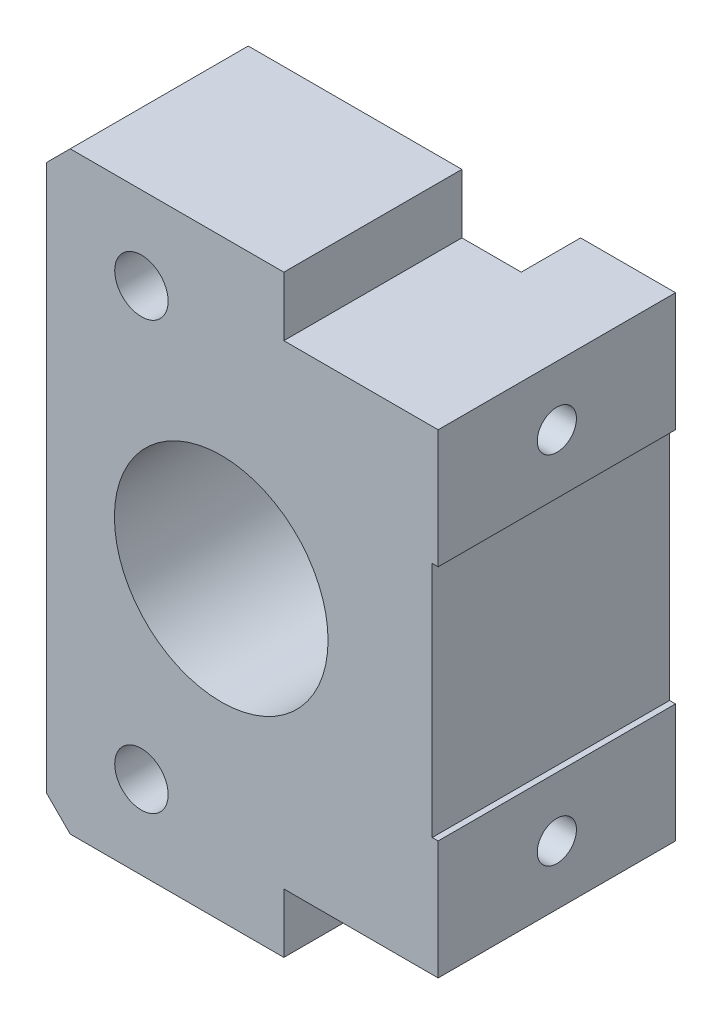
ISO-10303-21;
HEADER;
FILE_DESCRIPTION(('STEP AP214'),'2;1');
FILE_NAME('part.step','',(''),(''),'','','');
FILE_SCHEMA(('AUTOMOTIVE_DESIGN { 1 0 10303 214 1 1 1 1 }'));
ENDSEC;
DATA;
#1=APPLICATION_CONTEXT('core data for automotive mechanical design processes');
#2=APPLICATION_PROTOCOL_DEFINITION('international standard','automotive_design',2000,#1);
#3=PRODUCT_CONTEXT('',#1,'mechanical');
#4=PRODUCT('Part','Part','',(#3));
#5=PRODUCT_RELATED_PRODUCT_CATEGORY('part','',(#4));
#6=PRODUCT_DEFINITION_FORMATION('','',#4);
#7=PRODUCT_DEFINITION_CONTEXT('part definition',#1,'design');
#8=PRODUCT_DEFINITION('design','',#6,#7);
#9=PRODUCT_DEFINITION_SHAPE('','',#8);
#10=(LENGTH_UNIT() NAMED_UNIT(*) SI_UNIT(.MILLI.,.METRE.));
#11=(NAMED_UNIT(*) PLANE_ANGLE_UNIT() SI_UNIT($,.RADIAN.));
#12=(NAMED_UNIT(*) SI_UNIT($,.STERADIAN.) SOLID_ANGLE_UNIT());
#13=UNCERTAINTY_MEASURE_WITH_UNIT(LENGTH_MEASURE(1.E-05),#10,'distance_accuracy_value','');
#14=(GEOMETRIC_REPRESENTATION_CONTEXT(3) GLOBAL_UNCERTAINTY_ASSIGNED_CONTEXT((#13)) GLOBAL_UNIT_ASSIGNED_CONTEXT((#10,
#11,#12)) REPRESENTATION_CONTEXT('',''));
#15=CARTESIAN_POINT('',(0.,0.,0.));
#16=DIRECTION('',(0.,0.,1.));
#17=DIRECTION('',(1.,0.,0.));
#18=AXIS2_PLACEMENT_3D('',#15,#16,#17);
#19=CARTESIAN_POINT('',(0.,0.,15.));
#20=DIRECTION('',(0.,0.,-1.));
#21=DIRECTION('',(-1.,0.,0.));
#22=AXIS2_PLACEMENT_3D('',#19,#20,#21);
#23=PLANE('',#22);
#24=CARTESIAN_POINT('',(-30.3333333333333,-18.2777777777778,15.));
#25=DIRECTION('',(0.,0.,-1.));
#26=DIRECTION('',(-1.,0.,0.));
#27=AXIS2_PLACEMENT_3D('',#24,#25,#26);
#28=CIRCLE('',#27,2.25);
#29=CARTESIAN_POINT('',(-32.5833333333333,-18.2777777777778,15.));
#30=VERTEX_POINT('',#29);
#31=EDGE_CURVE('E209',#30,#30,#28,.T.);
#32=ORIENTED_EDGE('',*,*,#31,.T.);
#33=EDGE_LOOP('',(#32));
#34=FACE_BOUND('',#33,.T.);
#35=CARTESIAN_POINT('',(-30.3333333333333,17.7222222222222,15.));
#36=DIRECTION('',(0.,0.,-1.));
#37=DIRECTION('',(-1.,0.,0.));
#38=AXIS2_PLACEMENT_3D('',#35,#36,#37);
#39=CIRCLE('',#38,2.25);
#40=CARTESIAN_POINT('',(-32.5833333333333,17.7222222222222,15.));
#41=VERTEX_POINT('',#40);
#42=EDGE_CURVE('E215',#41,#41,#39,.T.);
#43=ORIENTED_EDGE('',*,*,#42,.T.);
#44=EDGE_LOOP('',(#43));
#45=FACE_BOUND('',#44,.T.);
#46=DIRECTION('',(-1.,0.,0.));
#47=VECTOR('',#46,1.);
#48=CARTESIAN_POINT('',(-38.3333333333333,24.7222222222222,15.));
#49=LINE('',#48,#47);
#50=CARTESIAN_POINT('',(-18.3333333333333,24.7222222222222,15.));
#51=VERTEX_POINT('',#50);
#52=CARTESIAN_POINT('',(-36.3333333333333,24.7222222222222,15.));
#53=VERTEX_POINT('',#52);
#54=EDGE_CURVE('E260',#51,#53,#49,.T.);
#55=ORIENTED_EDGE('',*,*,#54,.T.);
#56=DIRECTION('',(0.707106781186549,0.707106781186546,0.));
#57=VECTOR('',#56,1.);
#58=CARTESIAN_POINT('',(-38.3333333333333,22.7222222222222,15.));
#59=LINE('',#58,#57);
#60=CARTESIAN_POINT('',(-38.3333333333333,22.7222222222222,15.));
#61=VERTEX_POINT('',#60);
#62=EDGE_CURVE('E43',#53,#61,#59,.F.);
#63=ORIENTED_EDGE('',*,*,#62,.T.);
#64=DIRECTION('',(0.,-1.,0.));
#65=VECTOR('',#64,1.);
#66=CARTESIAN_POINT('',(-38.3333333333333,-25.2777777777778,15.));
#67=LINE('',#66,#65);
#68=CARTESIAN_POINT('',(-38.3333333333333,-23.2777777777778,15.));
#69=VERTEX_POINT('',#68);
#70=EDGE_CURVE('E262',#61,#69,#67,.T.);
#71=ORIENTED_EDGE('',*,*,#70,.T.);
#72=DIRECTION('',(-0.707106781186546,0.707106781186549,0.));
#73=VECTOR('',#72,1.);
#74=CARTESIAN_POINT('',(-36.3333333333333,-25.2777777777778,15.));
#75=LINE('',#74,#73);
#76=CARTESIAN_POINT('',(-36.3333333333333,-25.2777777777778,15.));
#77=VERTEX_POINT('',#76);
#78=EDGE_CURVE('E50',#69,#77,#75,.F.);
#79=ORIENTED_EDGE('',*,*,#78,.T.);
#80=DIRECTION('',(1.,0.,0.));
#81=VECTOR('',#80,1.);
#82=CARTESIAN_POINT('',(-18.3333333333333,-25.2777777777778,15.));
#83=LINE('',#82,#81);
#84=CARTESIAN_POINT('',(-18.3333333333333,-25.2777777777778,15.));
#85=VERTEX_POINT('',#84);
#86=EDGE_CURVE('E239',#77,#85,#83,.T.);
#87=ORIENTED_EDGE('',*,*,#86,.T.);
#88=DIRECTION('',(0.,1.,0.));
#89=VECTOR('',#88,1.);
#90=CARTESIAN_POINT('',(-18.3333333333333,-20.2777777777778,15.));
#91=LINE('',#90,#89);
#92=CARTESIAN_POINT('',(-18.3333333333333,-20.2777777777778,15.));
#93=VERTEX_POINT('',#92);
#94=EDGE_CURVE('E241',#85,#93,#91,.T.);
#95=ORIENTED_EDGE('',*,*,#94,.T.);
#96=DIRECTION('',(1.,0.,0.));
#97=VECTOR('',#96,1.);
#98=CARTESIAN_POINT('',(-5.33333333333332,-20.2777777777778,15.));
#99=LINE('',#98,#97);
#100=CARTESIAN_POINT('',(-5.33333333333332,-20.2777777777778,15.));
#101=VERTEX_POINT('',#100);
#102=EDGE_CURVE('E244',#93,#101,#99,.T.);
#103=ORIENTED_EDGE('',*,*,#102,.T.);
#104=DIRECTION('',(0.,1.,0.));
#105=VECTOR('',#104,1.);
#106=CARTESIAN_POINT('',(-5.33333333333333,-10.2777777777778,15.));
#107=LINE('',#106,#105);
#108=CARTESIAN_POINT('',(-5.33333333333333,-10.2777777777778,15.));
#109=VERTEX_POINT('',#108);
#110=EDGE_CURVE('E246',#101,#109,#107,.T.);
#111=ORIENTED_EDGE('',*,*,#110,.T.);
#112=DIRECTION('',(-1.,0.,0.));
#113=VECTOR('',#112,1.);
#114=CARTESIAN_POINT('',(-5.83333333333334,-10.2777777777778,15.));
#115=LINE('',#114,#113);
#116=CARTESIAN_POINT('',(-5.83333333333334,-10.2777777777778,15.));
#117=VERTEX_POINT('',#116);
#118=EDGE_CURVE('E248',#109,#117,#115,.T.);
#119=ORIENTED_EDGE('',*,*,#118,.T.);
#120=DIRECTION('',(0.,1.,0.));
#121=VECTOR('',#120,1.);
#122=CARTESIAN_POINT('',(-5.83333333333335,9.72222222222221,15.));
#123=LINE('',#122,#121);
#124=CARTESIAN_POINT('',(-5.83333333333335,9.72222222222221,15.));
#125=VERTEX_POINT('',#124);
#126=EDGE_CURVE('E250',#117,#125,#123,.T.);
#127=ORIENTED_EDGE('',*,*,#126,.T.);
#128=DIRECTION('',(1.,0.,0.));
#129=VECTOR('',#128,1.);
#130=CARTESIAN_POINT('',(-5.33333333333335,9.72222222222221,15.));
#131=LINE('',#130,#129);
#132=CARTESIAN_POINT('',(-5.33333333333335,9.72222222222221,15.));
#133=VERTEX_POINT('',#132);
#134=EDGE_CURVE('E252',#125,#133,#131,.T.);
#135=ORIENTED_EDGE('',*,*,#134,.T.);
#136=DIRECTION('',(0.,1.,0.));
#137=VECTOR('',#136,1.);
#138=CARTESIAN_POINT('',(-5.33333333333335,19.7222222222222,15.));
#139=LINE('',#138,#137);
#140=CARTESIAN_POINT('',(-5.33333333333335,19.7222222222222,15.));
#141=VERTEX_POINT('',#140);
#142=EDGE_CURVE('E254',#133,#141,#139,.T.);
#143=ORIENTED_EDGE('',*,*,#142,.T.);
#144=DIRECTION('',(-1.,0.,0.));
#145=VECTOR('',#144,1.);
#146=CARTESIAN_POINT('',(-18.3333333333333,19.7222222222222,15.));
#147=LINE('',#146,#145);
#148=CARTESIAN_POINT('',(-18.3333333333333,19.7222222222222,15.));
#149=VERTEX_POINT('',#148);
#150=EDGE_CURVE('E256',#141,#149,#147,.T.);
#151=ORIENTED_EDGE('',*,*,#150,.T.);
#152=DIRECTION('',(0.,1.,0.));
#153=VECTOR('',#152,1.);
#154=CARTESIAN_POINT('',(-18.3333333333333,24.7222222222222,15.));
#155=LINE('',#154,#153);
#156=EDGE_CURVE('E258',#149,#51,#155,.T.);
#157=ORIENTED_EDGE('',*,*,#156,.T.);
#158=EDGE_LOOP('',(#55,#63,#71,#79,#87,#95,#103,#111,#119,#127,#135,#143,#151,#157));
#159=FACE_BOUND('',#158,.T.);
#160=CARTESIAN_POINT('',(-23.6085196490635,-0.277777777777787,15.));
#161=DIRECTION('',(0.,0.,1.));
#162=DIRECTION('',(1.,0.,0.));
#163=AXIS2_PLACEMENT_3D('',#160,#161,#162);
#164=CIRCLE('',#163,9.);
#165=CARTESIAN_POINT('',(-14.6085196490635,-0.277777777777787,15.));
#166=VERTEX_POINT('',#165);
#167=EDGE_CURVE('E233',#166,#166,#164,.T.);
#168=ORIENTED_EDGE('',*,*,#167,.F.);
#169=EDGE_LOOP('',(#168));
#170=FACE_BOUND('',#169,.T.);
#171=ADVANCED_FACE('F35',(#34,#45,#159,#170),#23,.F.);
#172=CARTESIAN_POINT('',(0.,0.,0.));
#173=DIRECTION('',(0.,0.,-1.));
#174=DIRECTION('',(-1.,0.,0.));
#175=AXIS2_PLACEMENT_3D('',#172,#173,#174);
#176=PLANE('',#175);
#177=DIRECTION('',(0.,-1.,0.));
#178=VECTOR('',#177,1.);
#179=CARTESIAN_POINT('',(-38.3333333333333,-25.2777777777778,0.));
#180=LINE('',#179,#178);
#181=CARTESIAN_POINT('',(-38.3333333333333,22.7222222222222,0.));
#182=VERTEX_POINT('',#181);
#183=CARTESIAN_POINT('',(-38.3333333333333,-23.2777777777778,0.));
#184=VERTEX_POINT('',#183);
#185=EDGE_CURVE('E242',#182,#184,#180,.T.);
#186=ORIENTED_EDGE('',*,*,#185,.F.);
#187=DIRECTION('',(-0.707106781186549,-0.707106781186546,0.));
#188=VECTOR('',#187,1.);
#189=CARTESIAN_POINT('',(-30.5277777777777,30.5277777777778,0.));
#190=LINE('',#189,#188);
#191=CARTESIAN_POINT('',(-36.3333333333333,24.7222222222222,0.));
#192=VERTEX_POINT('',#191);
#193=EDGE_CURVE('E309',#182,#192,#190,.F.);
#194=ORIENTED_EDGE('',*,*,#193,.T.);
#195=DIRECTION('',(-1.,0.,0.));
#196=VECTOR('',#195,1.);
#197=CARTESIAN_POINT('',(-38.3333333333333,24.7222222222222,0.));
#198=LINE('',#197,#196);
#199=CARTESIAN_POINT('',(-18.3333333333333,24.7222222222222,0.));
#200=VERTEX_POINT('',#199);
#201=EDGE_CURVE('E275',#200,#192,#198,.T.);
#202=ORIENTED_EDGE('',*,*,#201,.F.);
#203=DIRECTION('',(0.,1.,0.));
#204=VECTOR('',#203,1.);
#205=CARTESIAN_POINT('',(-18.3333333333333,24.7222222222222,0.));
#206=LINE('',#205,#204);
#207=CARTESIAN_POINT('',(-18.3333333333333,19.7222222222222,0.));
#208=VERTEX_POINT('',#207);
#209=EDGE_CURVE('E273',#208,#200,#206,.T.);
#210=ORIENTED_EDGE('',*,*,#209,.F.);
#211=DIRECTION('',(-1.,0.,0.));
#212=VECTOR('',#211,1.);
#213=CARTESIAN_POINT('',(-18.3333333333333,19.7222222222222,0.));
#214=LINE('',#213,#212);
#215=CARTESIAN_POINT('',(-13.3333333333333,19.7222222222222,0.));
#216=VERTEX_POINT('',#215);
#217=EDGE_CURVE('E271',#216,#208,#214,.T.);
#218=ORIENTED_EDGE('',*,*,#217,.F.);
#219=DIRECTION('',(0.,1.,0.));
#220=VECTOR('',#219,1.);
#221=CARTESIAN_POINT('',(-13.3333333333333,19.7222222222222,0.));
#222=LINE('',#221,#220);
#223=CARTESIAN_POINT('',(-13.3333333333333,-20.2777777777778,0.));
#224=VERTEX_POINT('',#223);
#225=EDGE_CURVE('E176',#224,#216,#222,.T.);
#226=ORIENTED_EDGE('',*,*,#225,.F.);
#227=DIRECTION('',(1.,0.,0.));
#228=VECTOR('',#227,1.);
#229=CARTESIAN_POINT('',(-5.33333333333332,-20.2777777777778,0.));
#230=LINE('',#229,#228);
#231=CARTESIAN_POINT('',(-18.3333333333333,-20.2777777777778,0.));
#232=VERTEX_POINT('',#231);
#233=EDGE_CURVE('E268',#232,#224,#230,.T.);
#234=ORIENTED_EDGE('',*,*,#233,.F.);
#235=DIRECTION('',(0.,1.,0.));
#236=VECTOR('',#235,1.);
#237=CARTESIAN_POINT('',(-18.3333333333333,-20.2777777777778,0.));
#238=LINE('',#237,#236);
#239=CARTESIAN_POINT('',(-18.3333333333333,-25.2777777777778,0.));
#240=VERTEX_POINT('',#239);
#241=EDGE_CURVE('E266',#240,#232,#238,.T.);
#242=ORIENTED_EDGE('',*,*,#241,.F.);
#243=DIRECTION('',(1.,0.,0.));
#244=VECTOR('',#243,1.);
#245=CARTESIAN_POINT('',(-18.3333333333333,-25.2777777777778,0.));
#246=LINE('',#245,#244);
#247=CARTESIAN_POINT('',(-36.3333333333333,-25.2777777777778,0.));
#248=VERTEX_POINT('',#247);
#249=EDGE_CURVE('E236',#248,#240,#246,.T.);
#250=ORIENTED_EDGE('',*,*,#249,.F.);
#251=DIRECTION('',(0.707106781186546,-0.707106781186549,0.));
#252=VECTOR('',#251,1.);
#253=CARTESIAN_POINT('',(-30.8055555555556,-30.8055555555555,0.));
#254=LINE('',#253,#252);
#255=EDGE_CURVE('E307',#248,#184,#254,.F.);
#256=ORIENTED_EDGE('',*,*,#255,.T.);
#257=EDGE_LOOP('',(#186,#194,#202,#210,#218,#226,#234,#242,#250,#256));
#258=FACE_BOUND('',#257,.T.);
#259=CARTESIAN_POINT('',(-30.3333333333333,-18.2777777777778,0.));
#260=DIRECTION('',(0.,0.,-1.));
#261=DIRECTION('',(-1.,0.,0.));
#262=AXIS2_PLACEMENT_3D('',#259,#260,#261);
#263=CIRCLE('',#262,4.00000000000001);
#264=CARTESIAN_POINT('',(-34.3333333333333,-18.2777777777778,0.));
#265=VERTEX_POINT('',#264);
#266=EDGE_CURVE('E218',#265,#265,#263,.T.);
#267=ORIENTED_EDGE('',*,*,#266,.F.);
#268=EDGE_LOOP('',(#267));
#269=FACE_BOUND('',#268,.T.);
#270=CARTESIAN_POINT('',(-30.3333333333333,17.7222222222222,0.));
#271=DIRECTION('',(0.,0.,-1.));
#272=DIRECTION('',(-1.,0.,0.));
#273=AXIS2_PLACEMENT_3D('',#270,#271,#272);
#274=CIRCLE('',#273,4.00000000000001);
#275=CARTESIAN_POINT('',(-34.3333333333333,17.7222222222222,0.));
#276=VERTEX_POINT('',#275);
#277=EDGE_CURVE('E224',#276,#276,#274,.T.);
#278=ORIENTED_EDGE('',*,*,#277,.F.);
#279=EDGE_LOOP('',(#278));
#280=FACE_BOUND('',#279,.T.);
#281=CARTESIAN_POINT('',(-23.6085196490635,-0.277777777777787,0.));
#282=DIRECTION('',(0.,0.,1.));
#283=DIRECTION('',(1.,0.,0.));
#284=AXIS2_PLACEMENT_3D('',#281,#282,#283);
#285=CIRCLE('',#284,9.);
#286=CARTESIAN_POINT('',(-14.6085196490635,-0.277777777777787,0.));
#287=VERTEX_POINT('',#286);
#288=EDGE_CURVE('E230',#287,#287,#285,.T.);
#289=ORIENTED_EDGE('',*,*,#288,.T.);
#290=EDGE_LOOP('',(#289));
#291=FACE_BOUND('',#290,.T.);
#292=ADVANCED_FACE('F324',(#258,#269,#280,#291),#176,.T.);
#293=CARTESIAN_POINT('',(-18.3333333333333,-25.2777777777778,15.));
#294=DIRECTION('',(0.,1.,0.));
#295=DIRECTION('',(-1.,0.,0.));
#296=AXIS2_PLACEMENT_3D('',#293,#294,#295);
#297=PLANE('',#296);
#298=ORIENTED_EDGE('',*,*,#86,.F.);
#299=DIRECTION('',(0.,0.,-1.));
#300=VECTOR('',#299,1.);
#301=CARTESIAN_POINT('',(-36.3333333333333,-25.2777777777778,15.));
#302=LINE('',#301,#300);
#303=EDGE_CURVE('E11',#77,#248,#302,.T.);
#304=ORIENTED_EDGE('',*,*,#303,.T.);
#305=ORIENTED_EDGE('',*,*,#249,.T.);
#306=DIRECTION('',(0.,0.,-1.));
#307=VECTOR('',#306,1.);
#308=CARTESIAN_POINT('',(-18.3333333333333,-25.2777777777778,15.));
#309=LINE('',#308,#307);
#310=EDGE_CURVE('E299',#85,#240,#309,.T.);
#311=ORIENTED_EDGE('',*,*,#310,.F.);
#312=EDGE_LOOP('',(#298,#304,#305,#311));
#313=FACE_BOUND('',#312,.T.);
#314=ADVANCED_FACE('F354',(#313),#297,.F.);
#315=CARTESIAN_POINT('',(-18.3333333333333,-20.2777777777778,15.));
#316=DIRECTION('',(-1.,0.,0.));
#317=DIRECTION('',(0.,0.,1.));
#318=AXIS2_PLACEMENT_3D('',#315,#316,#317);
#319=PLANE('',#318);
#320=ORIENTED_EDGE('',*,*,#241,.T.);
#321=DIRECTION('',(0.,0.,-1.));
#322=VECTOR('',#321,1.);
#323=CARTESIAN_POINT('',(-18.3333333333333,-20.2777777777778,15.));
#324=LINE('',#323,#322);
#325=EDGE_CURVE('E296',#93,#232,#324,.T.);
#326=ORIENTED_EDGE('',*,*,#325,.F.);
#327=ORIENTED_EDGE('',*,*,#94,.F.);
#328=ORIENTED_EDGE('',*,*,#310,.T.);
#329=EDGE_LOOP('',(#320,#326,#327,#328));
#330=FACE_BOUND('',#329,.T.);
#331=ADVANCED_FACE('F352',(#330),#319,.F.);
#332=CARTESIAN_POINT('',(-5.33333333333332,-20.2777777777778,15.));
#333=DIRECTION('',(0.,1.,0.));
#334=DIRECTION('',(0.,0.,1.));
#335=AXIS2_PLACEMENT_3D('',#332,#333,#334);
#336=PLANE('',#335);
#337=ORIENTED_EDGE('',*,*,#233,.T.);
#338=DIRECTION('',(0.,0.,1.));
#339=VECTOR('',#338,1.);
#340=CARTESIAN_POINT('',(-13.3333333333333,-20.2777777777778,-5.));
#341=LINE('',#340,#339);
#342=CARTESIAN_POINT('',(-13.3333333333333,-20.2777777777778,-5.));
#343=VERTEX_POINT('',#342);
#344=EDGE_CURVE('E200',#343,#224,#341,.T.);
#345=ORIENTED_EDGE('',*,*,#344,.F.);
#346=DIRECTION('',(-1.,0.,0.));
#347=VECTOR('',#346,1.);
#348=CARTESIAN_POINT('',(-13.3333333333333,-20.2777777777778,-5.));
#349=LINE('',#348,#347);
#350=CARTESIAN_POINT('',(-5.33333333333332,-20.2777777777778,-5.));
#351=VERTEX_POINT('',#350);
#352=EDGE_CURVE('E198',#351,#343,#349,.T.);
#353=ORIENTED_EDGE('',*,*,#352,.F.);
#354=DIRECTION('',(0.,0.,-1.));
#355=VECTOR('',#354,1.);
#356=CARTESIAN_POINT('',(-5.33333333333332,-20.2777777777778,15.));
#357=LINE('',#356,#355);
#358=EDGE_CURVE('E294',#101,#351,#357,.T.);
#359=ORIENTED_EDGE('',*,*,#358,.F.);
#360=ORIENTED_EDGE('',*,*,#102,.F.);
#361=ORIENTED_EDGE('',*,*,#325,.T.);
#362=EDGE_LOOP('',(#337,#345,#353,#359,#360,#361));
#363=FACE_BOUND('',#362,.T.);
#364=ADVANCED_FACE('F343',(#363),#336,.F.);
#365=CARTESIAN_POINT('',(-5.33333333333333,-10.2777777777778,15.));
#366=DIRECTION('',(-1.,0.,0.));
#367=DIRECTION('',(0.,-1.,0.));
#368=AXIS2_PLACEMENT_3D('',#365,#366,#367);
#369=PLANE('',#368);
#370=CARTESIAN_POINT('',(-5.33333333333334,-15.2777777777778,5.));
#371=DIRECTION('',(1.,0.,0.));
#372=DIRECTION('',(0.,0.,-1.));
#373=AXIS2_PLACEMENT_3D('',#370,#371,#372);
#374=CIRCLE('',#373,1.65);
#375=CARTESIAN_POINT('',(-5.33333333333334,-15.2777777777778,3.35));
#376=VERTEX_POINT('',#375);
#377=EDGE_CURVE('E165',#376,#376,#374,.T.);
#378=ORIENTED_EDGE('',*,*,#377,.F.);
#379=EDGE_LOOP('',(#378));
#380=FACE_BOUND('',#379,.T.);
#381=ORIENTED_EDGE('',*,*,#358,.T.);
#382=DIRECTION('',(0.,-1.,0.));
#383=VECTOR('',#382,1.);
#384=CARTESIAN_POINT('',(-5.33333333333332,-20.2777777777778,-5.));
#385=LINE('',#384,#383);
#386=CARTESIAN_POINT('',(-5.33333333333333,-10.2777777777778,-5.));
#387=VERTEX_POINT('',#386);
#388=EDGE_CURVE('E195',#387,#351,#385,.T.);
#389=ORIENTED_EDGE('',*,*,#388,.F.);
#390=DIRECTION('',(0.,0.,-1.));
#391=VECTOR('',#390,1.);
#392=CARTESIAN_POINT('',(-5.33333333333333,-10.2777777777778,15.));
#393=LINE('',#392,#391);
#394=EDGE_CURVE('E292',#109,#387,#393,.T.);
#395=ORIENTED_EDGE('',*,*,#394,.F.);
#396=ORIENTED_EDGE('',*,*,#110,.F.);
#397=EDGE_LOOP('',(#381,#389,#395,#396));
#398=FACE_BOUND('',#397,.T.);
#399=ADVANCED_FACE('F401',(#380,#398),#369,.F.);
#400=CARTESIAN_POINT('',(-5.83333333333334,-10.2777777777778,15.));
#401=DIRECTION('',(0.,-1.,0.));
#402=DIRECTION('',(1.,0.,0.));
#403=AXIS2_PLACEMENT_3D('',#400,#401,#402);
#404=PLANE('',#403);
#405=ORIENTED_EDGE('',*,*,#394,.T.);
#406=DIRECTION('',(1.,0.,0.));
#407=VECTOR('',#406,1.);
#408=CARTESIAN_POINT('',(-5.33333333333333,-10.2777777777778,-5.));
#409=LINE('',#408,#407);
#410=CARTESIAN_POINT('',(-5.83333333333334,-10.2777777777778,-5.));
#411=VERTEX_POINT('',#410);
#412=EDGE_CURVE('E192',#411,#387,#409,.T.);
#413=ORIENTED_EDGE('',*,*,#412,.F.);
#414=DIRECTION('',(0.,0.,-1.));
#415=VECTOR('',#414,1.);
#416=CARTESIAN_POINT('',(-5.83333333333334,-10.2777777777778,15.));
#417=LINE('',#416,#415);
#418=EDGE_CURVE('E290',#117,#411,#417,.T.);
#419=ORIENTED_EDGE('',*,*,#418,.F.);
#420=ORIENTED_EDGE('',*,*,#118,.F.);
#421=EDGE_LOOP('',(#405,#413,#419,#420));
#422=FACE_BOUND('',#421,.T.);
#423=ADVANCED_FACE('F397',(#422),#404,.F.);
#424=CARTESIAN_POINT('',(-5.83333333333335,9.72222222222221,15.));
#425=DIRECTION('',(-1.,0.,0.));
#426=DIRECTION('',(0.,-1.,0.));
#427=AXIS2_PLACEMENT_3D('',#424,#425,#426);
#428=PLANE('',#427);
#429=ORIENTED_EDGE('',*,*,#418,.T.);
#430=DIRECTION('',(0.,-1.,0.));
#431=VECTOR('',#430,1.);
#432=CARTESIAN_POINT('',(-5.83333333333334,-10.2777777777778,-5.));
#433=LINE('',#432,#431);
#434=CARTESIAN_POINT('',(-5.83333333333335,9.72222222222221,-5.));
#435=VERTEX_POINT('',#434);
#436=EDGE_CURVE('E189',#435,#411,#433,.T.);
#437=ORIENTED_EDGE('',*,*,#436,.F.);
#438=DIRECTION('',(0.,0.,-1.));
#439=VECTOR('',#438,1.);
#440=CARTESIAN_POINT('',(-5.83333333333335,9.72222222222221,15.));
#441=LINE('',#440,#439);
#442=EDGE_CURVE('E288',#125,#435,#441,.T.);
#443=ORIENTED_EDGE('',*,*,#442,.F.);
#444=ORIENTED_EDGE('',*,*,#126,.F.);
#445=EDGE_LOOP('',(#429,#437,#443,#444));
#446=FACE_BOUND('',#445,.T.);
#447=ADVANCED_FACE('F393',(#446),#428,.F.);
#448=CARTESIAN_POINT('',(-5.33333333333335,9.72222222222221,15.));
#449=DIRECTION('',(0.,1.,0.));
#450=DIRECTION('',(0.,0.,1.));
#451=AXIS2_PLACEMENT_3D('',#448,#449,#450);
#452=PLANE('',#451);
#453=ORIENTED_EDGE('',*,*,#442,.T.);
#454=DIRECTION('',(-1.,0.,0.));
#455=VECTOR('',#454,1.);
#456=CARTESIAN_POINT('',(-5.83333333333335,9.72222222222221,-5.));
#457=LINE('',#456,#455);
#458=CARTESIAN_POINT('',(-5.33333333333335,9.72222222222221,-5.));
#459=VERTEX_POINT('',#458);
#460=EDGE_CURVE('E186',#459,#435,#457,.T.);
#461=ORIENTED_EDGE('',*,*,#460,.F.);
#462=DIRECTION('',(0.,0.,-1.));
#463=VECTOR('',#462,1.);
#464=CARTESIAN_POINT('',(-5.33333333333335,9.72222222222221,15.));
#465=LINE('',#464,#463);
#466=EDGE_CURVE('E286',#133,#459,#465,.T.);
#467=ORIENTED_EDGE('',*,*,#466,.F.);
#468=ORIENTED_EDGE('',*,*,#134,.F.);
#469=EDGE_LOOP('',(#453,#461,#467,#468));
#470=FACE_BOUND('',#469,.T.);
#471=ADVANCED_FACE('F389',(#470),#452,.F.);
#472=CARTESIAN_POINT('',(-5.33333333333335,19.7222222222222,15.));
#473=DIRECTION('',(-1.,0.,0.));
#474=DIRECTION('',(0.,-1.,0.));
#475=AXIS2_PLACEMENT_3D('',#472,#473,#474);
#476=PLANE('',#475);
#477=CARTESIAN_POINT('',(-5.33333333333335,14.7222222222222,5.));
#478=DIRECTION('',(1.,0.,0.));
#479=DIRECTION('',(0.,0.,-1.));
#480=AXIS2_PLACEMENT_3D('',#477,#478,#479);
#481=CIRCLE('',#480,1.65);
#482=CARTESIAN_POINT('',(-5.33333333333335,14.7222222222222,3.35));
#483=VERTEX_POINT('',#482);
#484=EDGE_CURVE('E166',#483,#483,#481,.T.);
#485=ORIENTED_EDGE('',*,*,#484,.F.);
#486=EDGE_LOOP('',(#485));
#487=FACE_BOUND('',#486,.T.);
#488=ORIENTED_EDGE('',*,*,#466,.T.);
#489=DIRECTION('',(0.,-1.,0.));
#490=VECTOR('',#489,1.);
#491=CARTESIAN_POINT('',(-5.33333333333335,9.72222222222221,-5.));
#492=LINE('',#491,#490);
#493=CARTESIAN_POINT('',(-5.33333333333335,19.7222222222222,-5.));
#494=VERTEX_POINT('',#493);
#495=EDGE_CURVE('E183',#494,#459,#492,.T.);
#496=ORIENTED_EDGE('',*,*,#495,.F.);
#497=DIRECTION('',(0.,0.,-1.));
#498=VECTOR('',#497,1.);
#499=CARTESIAN_POINT('',(-5.33333333333335,19.7222222222222,15.));
#500=LINE('',#499,#498);
#501=EDGE_CURVE('E284',#141,#494,#500,.T.);
#502=ORIENTED_EDGE('',*,*,#501,.F.);
#503=ORIENTED_EDGE('',*,*,#142,.F.);
#504=EDGE_LOOP('',(#488,#496,#502,#503));
#505=FACE_BOUND('',#504,.T.);
#506=ADVANCED_FACE('F386',(#487,#505),#476,.F.);
#507=CARTESIAN_POINT('',(-18.3333333333333,19.7222222222222,15.));
#508=DIRECTION('',(0.,-1.,0.));
#509=DIRECTION('',(0.,0.,-1.));
#510=AXIS2_PLACEMENT_3D('',#507,#508,#509);
#511=PLANE('',#510);
#512=ORIENTED_EDGE('',*,*,#501,.T.);
#513=DIRECTION('',(1.,0.,0.));
#514=VECTOR('',#513,1.);
#515=CARTESIAN_POINT('',(-5.33333333333335,19.7222222222222,-5.));
#516=LINE('',#515,#514);
#517=CARTESIAN_POINT('',(-13.3333333333333,19.7222222222222,-5.));
#518=VERTEX_POINT('',#517);
#519=EDGE_CURVE('E180',#518,#494,#516,.T.);
#520=ORIENTED_EDGE('',*,*,#519,.F.);
#521=DIRECTION('',(0.,0.,1.));
#522=VECTOR('',#521,1.);
#523=CARTESIAN_POINT('',(-13.3333333333333,19.7222222222222,-5.));
#524=LINE('',#523,#522);
#525=EDGE_CURVE('E205',#518,#216,#524,.T.);
#526=ORIENTED_EDGE('',*,*,#525,.T.);
#527=ORIENTED_EDGE('',*,*,#217,.T.);
#528=DIRECTION('',(0.,0.,-1.));
#529=VECTOR('',#528,1.);
#530=CARTESIAN_POINT('',(-18.3333333333333,19.7222222222222,15.));
#531=LINE('',#530,#529);
#532=EDGE_CURVE('E281',#149,#208,#531,.T.);
#533=ORIENTED_EDGE('',*,*,#532,.F.);
#534=ORIENTED_EDGE('',*,*,#150,.F.);
#535=EDGE_LOOP('',(#512,#520,#526,#527,#533,#534));
#536=FACE_BOUND('',#535,.T.);
#537=ADVANCED_FACE('F336',(#536),#511,.F.);
#538=CARTESIAN_POINT('',(-18.3333333333333,24.7222222222222,15.));
#539=DIRECTION('',(-1.,0.,0.));
#540=DIRECTION('',(0.,-1.,0.));
#541=AXIS2_PLACEMENT_3D('',#538,#539,#540);
#542=PLANE('',#541);
#543=ORIENTED_EDGE('',*,*,#209,.T.);
#544=DIRECTION('',(0.,0.,-1.));
#545=VECTOR('',#544,1.);
#546=CARTESIAN_POINT('',(-18.3333333333333,24.7222222222222,15.));
#547=LINE('',#546,#545);
#548=EDGE_CURVE('E264',#51,#200,#547,.T.);
#549=ORIENTED_EDGE('',*,*,#548,.F.);
#550=ORIENTED_EDGE('',*,*,#156,.F.);
#551=ORIENTED_EDGE('',*,*,#532,.T.);
#552=EDGE_LOOP('',(#543,#549,#550,#551));
#553=FACE_BOUND('',#552,.T.);
#554=ADVANCED_FACE('F331',(#553),#542,.F.);
#555=CARTESIAN_POINT('',(-38.3333333333333,24.7222222222222,15.));
#556=DIRECTION('',(0.,-1.,0.));
#557=DIRECTION('',(0.,0.,-1.));
#558=AXIS2_PLACEMENT_3D('',#555,#556,#557);
#559=PLANE('',#558);
#560=ORIENTED_EDGE('',*,*,#201,.T.);
#561=DIRECTION('',(0.,0.,1.));
#562=VECTOR('',#561,1.);
#563=CARTESIAN_POINT('',(-36.3333333333333,24.7222222222222,15.));
#564=LINE('',#563,#562);
#565=EDGE_CURVE('E58',#192,#53,#564,.T.);
#566=ORIENTED_EDGE('',*,*,#565,.T.);
#567=ORIENTED_EDGE('',*,*,#54,.F.);
#568=ORIENTED_EDGE('',*,*,#548,.T.);
#569=EDGE_LOOP('',(#560,#566,#567,#568));
#570=FACE_BOUND('',#569,.T.);
#571=ADVANCED_FACE('F327',(#570),#559,.F.);
#572=CARTESIAN_POINT('',(-38.3333333333333,-25.2777777777778,15.));
#573=DIRECTION('',(1.,0.,0.));
#574=DIRECTION('',(0.,0.,-1.));
#575=AXIS2_PLACEMENT_3D('',#572,#573,#574);
#576=PLANE('',#575);
#577=ORIENTED_EDGE('',*,*,#70,.F.);
#578=DIRECTION('',(0.,0.,-1.));
#579=VECTOR('',#578,1.);
#580=CARTESIAN_POINT('',(-38.3333333333333,22.7222222222222,15.));
#581=LINE('',#580,#579);
#582=EDGE_CURVE('E304',#61,#182,#581,.T.);
#583=ORIENTED_EDGE('',*,*,#582,.T.);
#584=ORIENTED_EDGE('',*,*,#185,.T.);
#585=DIRECTION('',(0.,0.,1.));
#586=VECTOR('',#585,1.);
#587=CARTESIAN_POINT('',(-38.3333333333333,-23.2777777777778,15.));
#588=LINE('',#587,#586);
#589=EDGE_CURVE('E302',#184,#69,#588,.T.);
#590=ORIENTED_EDGE('',*,*,#589,.T.);
#591=EDGE_LOOP('',(#577,#583,#584,#590));
#592=FACE_BOUND('',#591,.T.);
#593=ADVANCED_FACE('F318',(#592),#576,.F.);
#594=CARTESIAN_POINT('',(-23.6085196490635,-0.277777777777787,15.));
#595=DIRECTION('',(0.,0.,-1.));
#596=DIRECTION('',(-1.,0.,0.));
#597=AXIS2_PLACEMENT_3D('',#594,#595,#596);
#598=CYLINDRICAL_SURFACE('',#597,9.);
#599=ORIENTED_EDGE('',*,*,#167,.T.);
#600=EDGE_LOOP('',(#599));
#601=FACE_BOUND('',#600,.T.);
#602=ORIENTED_EDGE('',*,*,#288,.F.);
#603=EDGE_LOOP('',(#602));
#604=FACE_BOUND('',#603,.T.);
#605=ADVANCED_FACE('F375',(#601,#604),#598,.F.);
#606=CARTESIAN_POINT('',(-30.3333333333333,17.7222222222222,7.));
#607=DIRECTION('',(0.,0.,-1.));
#608=DIRECTION('',(-1.,0.,0.));
#609=AXIS2_PLACEMENT_3D('',#606,#607,#608);
#610=CYLINDRICAL_SURFACE('',#609,4.00000000000001);
#611=CARTESIAN_POINT('',(-30.3333333333333,17.7222222222222,7.));
#612=DIRECTION('',(0.,0.,-1.));
#613=DIRECTION('',(-1.,0.,0.));
#614=AXIS2_PLACEMENT_3D('',#611,#612,#613);
#615=CIRCLE('',#614,4.00000000000001);
#616=CARTESIAN_POINT('',(-34.3333333333333,17.7222222222222,7.));
#617=VERTEX_POINT('',#616);
#618=EDGE_CURVE('E227',#617,#617,#615,.T.);
#619=ORIENTED_EDGE('',*,*,#618,.F.);
#620=EDGE_LOOP('',(#619));
#621=FACE_BOUND('',#620,.T.);
#622=ORIENTED_EDGE('',*,*,#277,.T.);
#623=EDGE_LOOP('',(#622));
#624=FACE_BOUND('',#623,.T.);
#625=ADVANCED_FACE('F469',(#621,#624),#610,.F.);
#626=CARTESIAN_POINT('',(-30.3333333333333,17.7222222222222,7.));
#627=DIRECTION('',(0.,0.,-1.));
#628=DIRECTION('',(-1.,0.,0.));
#629=AXIS2_PLACEMENT_3D('',#626,#627,#628);
#630=PLANE('',#629);
#631=CARTESIAN_POINT('',(-30.3333333333333,17.7222222222222,7.));
#632=DIRECTION('',(0.,0.,-1.));
#633=DIRECTION('',(-1.,0.,0.));
#634=AXIS2_PLACEMENT_3D('',#631,#632,#633);
#635=CIRCLE('',#634,2.25);
#636=CARTESIAN_POINT('',(-32.5833333333333,17.7222222222222,7.));
#637=VERTEX_POINT('',#636);
#638=EDGE_CURVE('E212',#637,#637,#635,.T.);
#639=ORIENTED_EDGE('',*,*,#638,.F.);
#640=EDGE_LOOP('',(#639));
#641=FACE_BOUND('',#640,.T.);
#642=ORIENTED_EDGE('',*,*,#618,.T.);
#643=EDGE_LOOP('',(#642));
#644=FACE_BOUND('',#643,.T.);
#645=ADVANCED_FACE('F476',(#641,#644),#630,.T.);
#646=CARTESIAN_POINT('',(-30.3333333333333,-18.2777777777778,7.));
#647=DIRECTION('',(0.,0.,-1.));
#648=DIRECTION('',(-1.,0.,0.));
#649=AXIS2_PLACEMENT_3D('',#646,#647,#648);
#650=CYLINDRICAL_SURFACE('',#649,4.00000000000001);
#651=CARTESIAN_POINT('',(-30.3333333333333,-18.2777777777778,7.));
#652=DIRECTION('',(0.,0.,-1.));
#653=DIRECTION('',(-1.,0.,0.));
#654=AXIS2_PLACEMENT_3D('',#651,#652,#653);
#655=CIRCLE('',#654,4.00000000000001);
#656=CARTESIAN_POINT('',(-34.3333333333333,-18.2777777777778,7.));
#657=VERTEX_POINT('',#656);
#658=EDGE_CURVE('E221',#657,#657,#655,.T.);
#659=ORIENTED_EDGE('',*,*,#658,.F.);
#660=EDGE_LOOP('',(#659));
#661=FACE_BOUND('',#660,.T.);
#662=ORIENTED_EDGE('',*,*,#266,.T.);
#663=EDGE_LOOP('',(#662));
#664=FACE_BOUND('',#663,.T.);
#665=ADVANCED_FACE('F484',(#661,#664),#650,.F.);
#666=CARTESIAN_POINT('',(-30.3333333333333,-18.2777777777778,7.));
#667=DIRECTION('',(0.,0.,-1.));
#668=DIRECTION('',(-1.,0.,0.));
#669=AXIS2_PLACEMENT_3D('',#666,#667,#668);
#670=PLANE('',#669);
#671=CARTESIAN_POINT('',(-30.3333333333333,-18.2777777777778,7.));
#672=DIRECTION('',(0.,0.,-1.));
#673=DIRECTION('',(-1.,0.,0.));
#674=AXIS2_PLACEMENT_3D('',#671,#672,#673);
#675=CIRCLE('',#674,2.25);
#676=CARTESIAN_POINT('',(-32.5833333333333,-18.2777777777778,7.));
#677=VERTEX_POINT('',#676);
#678=EDGE_CURVE('E208',#677,#677,#675,.T.);
#679=ORIENTED_EDGE('',*,*,#678,.F.);
#680=EDGE_LOOP('',(#679));
#681=FACE_BOUND('',#680,.T.);
#682=ORIENTED_EDGE('',*,*,#658,.T.);
#683=EDGE_LOOP('',(#682));
#684=FACE_BOUND('',#683,.T.);
#685=ADVANCED_FACE('F492',(#681,#684),#670,.T.);
#686=CARTESIAN_POINT('',(-30.3333333333333,17.7222222222222,15.));
#687=DIRECTION('',(0.,0.,-1.));
#688=DIRECTION('',(-1.,0.,0.));
#689=AXIS2_PLACEMENT_3D('',#686,#687,#688);
#690=CYLINDRICAL_SURFACE('',#689,2.25);
#691=ORIENTED_EDGE('',*,*,#42,.F.);
#692=EDGE_LOOP('',(#691));
#693=FACE_BOUND('',#692,.T.);
#694=ORIENTED_EDGE('',*,*,#638,.T.);
#695=EDGE_LOOP('',(#694));
#696=FACE_BOUND('',#695,.T.);
#697=ADVANCED_FACE('F499',(#693,#696),#690,.F.);
#698=CARTESIAN_POINT('',(-30.3333333333333,-18.2777777777778,15.));
#699=DIRECTION('',(0.,0.,-1.));
#700=DIRECTION('',(-1.,0.,0.));
#701=AXIS2_PLACEMENT_3D('',#698,#699,#700);
#702=CYLINDRICAL_SURFACE('',#701,2.25);
#703=ORIENTED_EDGE('',*,*,#31,.F.);
#704=EDGE_LOOP('',(#703));
#705=FACE_BOUND('',#704,.T.);
#706=ORIENTED_EDGE('',*,*,#678,.T.);
#707=EDGE_LOOP('',(#706));
#708=FACE_BOUND('',#707,.T.);
#709=ADVANCED_FACE('F507',(#705,#708),#702,.F.);
#710=CARTESIAN_POINT('',(-13.3333333333333,19.7222222222222,-5.));
#711=DIRECTION('',(1.,0.,0.));
#712=DIRECTION('',(0.,1.,0.));
#713=AXIS2_PLACEMENT_3D('',#710,#711,#712);
#714=PLANE('',#713);
#715=ORIENTED_EDGE('',*,*,#225,.T.);
#716=ORIENTED_EDGE('',*,*,#525,.F.);
#717=DIRECTION('',(0.,1.,0.));
#718=VECTOR('',#717,1.);
#719=CARTESIAN_POINT('',(-13.3333333333333,19.7222222222222,-5.));
#720=LINE('',#719,#718);
#721=EDGE_CURVE('E177',#343,#518,#720,.T.);
#722=ORIENTED_EDGE('',*,*,#721,.F.);
#723=ORIENTED_EDGE('',*,*,#344,.T.);
#724=EDGE_LOOP('',(#715,#716,#722,#723));
#725=FACE_BOUND('',#724,.T.);
#726=ADVANCED_FACE('F339',(#725),#714,.F.);
#727=CARTESIAN_POINT('',(0.,0.,-5.));
#728=DIRECTION('',(0.,0.,1.));
#729=DIRECTION('',(1.,0.,0.));
#730=AXIS2_PLACEMENT_3D('',#727,#728,#729);
#731=PLANE('',#730);
#732=ORIENTED_EDGE('',*,*,#721,.T.);
#733=ORIENTED_EDGE('',*,*,#519,.T.);
#734=ORIENTED_EDGE('',*,*,#495,.T.);
#735=ORIENTED_EDGE('',*,*,#460,.T.);
#736=ORIENTED_EDGE('',*,*,#436,.T.);
#737=ORIENTED_EDGE('',*,*,#412,.T.);
#738=ORIENTED_EDGE('',*,*,#388,.T.);
#739=ORIENTED_EDGE('',*,*,#352,.T.);
#740=EDGE_LOOP('',(#732,#733,#734,#735,#736,#737,#738,#739));
#741=FACE_BOUND('',#740,.T.);
#742=ADVANCED_FACE('F365',(#741),#731,.F.);
#743=CARTESIAN_POINT('',(-38.3333333333333,22.7222222222222,15.));
#744=DIRECTION('',(0.707106781186546,-0.707106781186549,0.));
#745=DIRECTION('',(0.,0.,-1.));
#746=AXIS2_PLACEMENT_3D('',#743,#744,#745);
#747=PLANE('',#746);
#748=ORIENTED_EDGE('',*,*,#62,.F.);
#749=ORIENTED_EDGE('',*,*,#565,.F.);
#750=ORIENTED_EDGE('',*,*,#193,.F.);
#751=ORIENTED_EDGE('',*,*,#582,.F.);
#752=EDGE_LOOP('',(#748,#749,#750,#751));
#753=FACE_BOUND('',#752,.T.);
#754=ADVANCED_FACE('F321',(#753),#747,.F.);
#755=CARTESIAN_POINT('',(-36.3333333333333,-25.2777777777778,15.));
#756=DIRECTION('',(0.707106781186549,0.707106781186546,0.));
#757=DIRECTION('',(0.,0.,-1.));
#758=AXIS2_PLACEMENT_3D('',#755,#756,#757);
#759=PLANE('',#758);
#760=ORIENTED_EDGE('',*,*,#78,.F.);
#761=ORIENTED_EDGE('',*,*,#589,.F.);
#762=ORIENTED_EDGE('',*,*,#255,.F.);
#763=ORIENTED_EDGE('',*,*,#303,.F.);
#764=EDGE_LOOP('',(#760,#761,#762,#763));
#765=FACE_BOUND('',#764,.T.);
#766=ADVANCED_FACE('F37',(#765),#759,.F.);
#767=CARTESIAN_POINT('',(-13.3333333333333,-15.2777777777778,5.));
#768=DIRECTION('',(1.,0.,0.));
#769=DIRECTION('',(0.,0.,-1.));
#770=AXIS2_PLACEMENT_3D('',#767,#768,#769);
#771=CONICAL_SURFACE('',#770,1.65,1.02974425867665);
#772=CARTESIAN_POINT('',(-14.3247533547288,-15.2777777777778,5.));
#773=VERTEX_POINT('',#772);
#774=VERTEX_LOOP('',#773);
#775=FACE_BOUND('',#774,.T.);
#776=CARTESIAN_POINT('',(-13.3333333333333,-15.2777777777778,5.));
#777=DIRECTION('',(1.,0.,0.));
#778=DIRECTION('',(0.,0.,-1.));
#779=AXIS2_PLACEMENT_3D('',#776,#777,#778);
#780=CIRCLE('',#779,1.65);
#781=CARTESIAN_POINT('',(-13.3333333333333,-15.2777777777778,3.35));
#782=VERTEX_POINT('',#781);
#783=EDGE_CURVE('E169',#782,#782,#780,.T.);
#784=ORIENTED_EDGE('',*,*,#783,.T.);
#785=EDGE_LOOP('',(#784));
#786=FACE_BOUND('',#785,.T.);
#787=ADVANCED_FACE('F358',(#775,#786),#771,.F.);
#788=CARTESIAN_POINT('',(-5.33333333333334,-15.2777777777778,5.));
#789=DIRECTION('',(1.,0.,0.));
#790=DIRECTION('',(0.,0.,-1.));
#791=AXIS2_PLACEMENT_3D('',#788,#789,#790);
#792=CYLINDRICAL_SURFACE('',#791,1.65);
#793=ORIENTED_EDGE('',*,*,#783,.F.);
#794=EDGE_LOOP('',(#793));
#795=FACE_BOUND('',#794,.T.);
#796=ORIENTED_EDGE('',*,*,#377,.T.);
#797=EDGE_LOOP('',(#796));
#798=FACE_BOUND('',#797,.T.);
#799=ADVANCED_FACE('F159',(#795,#798),#792,.F.);
#800=CARTESIAN_POINT('',(-13.3333333333333,14.7222222222222,5.));
#801=DIRECTION('',(1.,0.,0.));
#802=DIRECTION('',(0.,0.,-1.));
#803=AXIS2_PLACEMENT_3D('',#800,#801,#802);
#804=CONICAL_SURFACE('',#803,1.65,1.02974425867665);
#805=CARTESIAN_POINT('',(-14.3247533547288,14.7222222222222,5.));
#806=VERTEX_POINT('',#805);
#807=VERTEX_LOOP('',#806);
#808=FACE_BOUND('',#807,.T.);
#809=CARTESIAN_POINT('',(-13.3333333333333,14.7222222222222,5.));
#810=DIRECTION('',(1.,0.,0.));
#811=DIRECTION('',(0.,0.,-1.));
#812=AXIS2_PLACEMENT_3D('',#809,#810,#811);
#813=CIRCLE('',#812,1.65);
#814=CARTESIAN_POINT('',(-13.3333333333333,14.7222222222222,3.35));
#815=VERTEX_POINT('',#814);
#816=EDGE_CURVE('E163',#815,#815,#813,.T.);
#817=ORIENTED_EDGE('',*,*,#816,.T.);
#818=EDGE_LOOP('',(#817));
#819=FACE_BOUND('',#818,.T.);
#820=ADVANCED_FACE('F155',(#808,#819),#804,.F.);
#821=CARTESIAN_POINT('',(-5.33333333333335,14.7222222222222,5.));
#822=DIRECTION('',(1.,0.,0.));
#823=DIRECTION('',(0.,0.,-1.));
#824=AXIS2_PLACEMENT_3D('',#821,#822,#823);
#825=CYLINDRICAL_SURFACE('',#824,1.65);
#826=ORIENTED_EDGE('',*,*,#816,.F.);
#827=EDGE_LOOP('',(#826));
#828=FACE_BOUND('',#827,.T.);
#829=ORIENTED_EDGE('',*,*,#484,.T.);
#830=EDGE_LOOP('',(#829));
#831=FACE_BOUND('',#830,.T.);
#832=ADVANCED_FACE('F158',(#828,#831),#825,.F.);
#833=CLOSED_SHELL('',(#171,#292,#314,#331,#364,#399,#423,#447,#471,#506,#537,#554,#571,#593,
#605,#625,#645,#665,#685,#697,#709,#726,#742,#754,#766,#787,#799,#820,#832));
#834=MANIFOLD_SOLID_BREP('B2',#833);
#835=ADVANCED_BREP_SHAPE_REPRESENTATION('',(#18,#834),#14);
#836=SHAPE_DEFINITION_REPRESENTATION(#9,#835);
ENDSEC;
END-ISO-10303-21;
